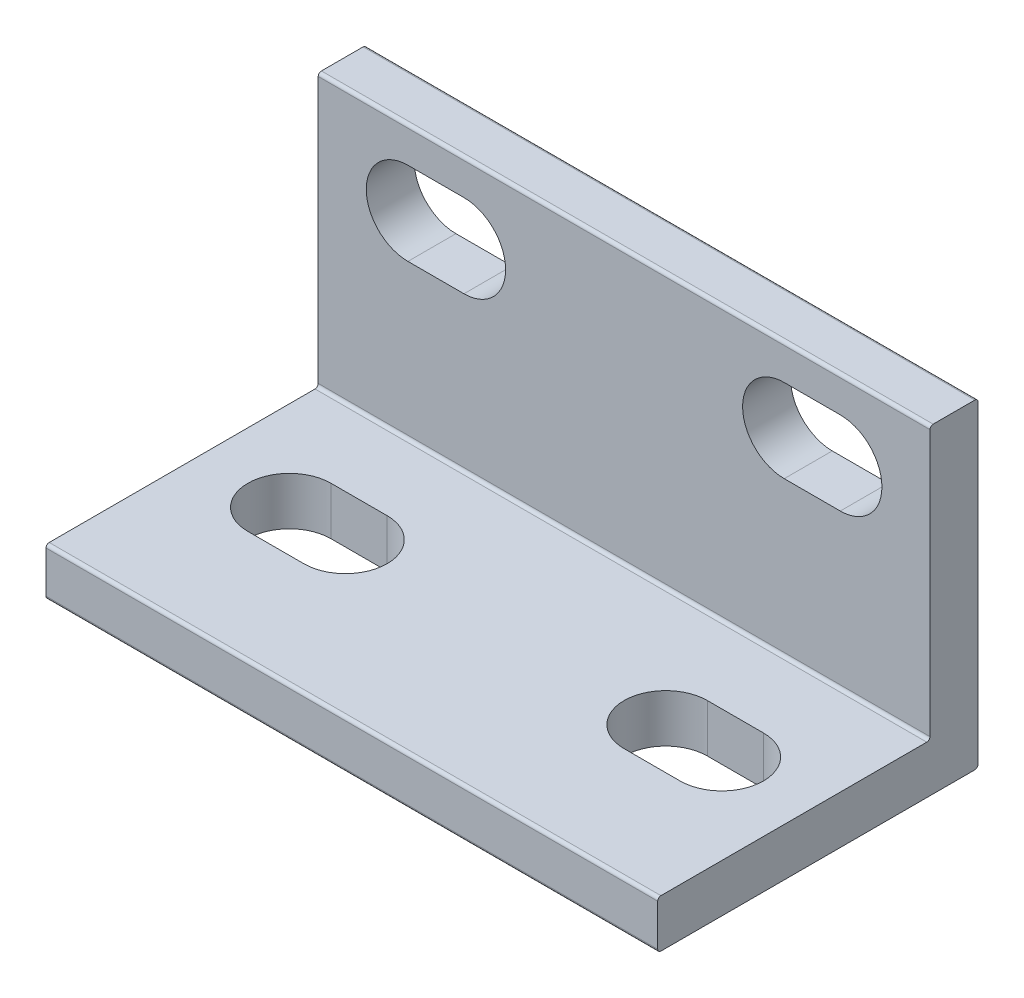
ISO-10303-21;
HEADER;
FILE_DESCRIPTION(('STEP AP214'),'2;1');
FILE_NAME('part.step','',(''),(''),'','','');
FILE_SCHEMA(('AUTOMOTIVE_DESIGN { 1 0 10303 214 1 1 1 1 }'));
ENDSEC;
DATA;
#1=APPLICATION_CONTEXT('core data for automotive mechanical design processes');
#2=APPLICATION_PROTOCOL_DEFINITION('international standard','automotive_design',2000,#1);
#3=PRODUCT_CONTEXT('',#1,'mechanical');
#4=PRODUCT('Part','Part','',(#3));
#5=PRODUCT_RELATED_PRODUCT_CATEGORY('part','',(#4));
#6=PRODUCT_DEFINITION_FORMATION('','',#4);
#7=PRODUCT_DEFINITION_CONTEXT('part definition',#1,'design');
#8=PRODUCT_DEFINITION('design','',#6,#7);
#9=PRODUCT_DEFINITION_SHAPE('','',#8);
#10=(LENGTH_UNIT() NAMED_UNIT(*) SI_UNIT(.MILLI.,.METRE.));
#11=(NAMED_UNIT(*) PLANE_ANGLE_UNIT() SI_UNIT($,.RADIAN.));
#12=(NAMED_UNIT(*) SI_UNIT($,.STERADIAN.) SOLID_ANGLE_UNIT());
#13=UNCERTAINTY_MEASURE_WITH_UNIT(LENGTH_MEASURE(1.E-05),#10,'distance_accuracy_value','');
#14=(GEOMETRIC_REPRESENTATION_CONTEXT(3) GLOBAL_UNCERTAINTY_ASSIGNED_CONTEXT((#13)) GLOBAL_UNIT_ASSIGNED_CONTEXT((#10,
#11,#12)) REPRESENTATION_CONTEXT('',''));
#15=CARTESIAN_POINT('',(0.,0.,0.));
#16=DIRECTION('',(0.,0.,1.));
#17=DIRECTION('',(1.,0.,0.));
#18=AXIS2_PLACEMENT_3D('',#15,#16,#17);
#19=CARTESIAN_POINT('',(0.,17.,3.));
#20=DIRECTION('',(1.,0.,0.));
#21=DIRECTION('',(0.,0.,-1.));
#22=AXIS2_PLACEMENT_3D('',#19,#20,#21);
#23=PLANE('',#22);
#24=DIRECTION('',(0.,-1.,0.));
#25=VECTOR('',#24,1.);
#26=CARTESIAN_POINT('',(0.,17.,3.));
#27=LINE('',#26,#25);
#28=CARTESIAN_POINT('',(0.,16.8,3.));
#29=VERTEX_POINT('',#28);
#30=CARTESIAN_POINT('',(0.,0.199999999999999,3.));
#31=VERTEX_POINT('',#30);
#32=EDGE_CURVE('E360',#29,#31,#27,.T.);
#33=ORIENTED_EDGE('',*,*,#32,.F.);
#34=CARTESIAN_POINT('',(0.,16.8,2.8));
#35=DIRECTION('',(1.,0.,0.));
#36=DIRECTION('',(0.,0.,-1.));
#37=AXIS2_PLACEMENT_3D('',#34,#35,#36);
#38=CIRCLE('',#37,0.2);
#39=CARTESIAN_POINT('',(0.,17.,2.8));
#40=VERTEX_POINT('',#39);
#41=EDGE_CURVE('E391',#29,#40,#38,.F.);
#42=ORIENTED_EDGE('',*,*,#41,.T.);
#43=DIRECTION('',(0.,0.,-1.));
#44=VECTOR('',#43,1.);
#45=CARTESIAN_POINT('',(0.,17.,3.));
#46=LINE('',#45,#44);
#47=CARTESIAN_POINT('',(0.,17.,0.2));
#48=VERTEX_POINT('',#47);
#49=EDGE_CURVE('E367',#40,#48,#46,.T.);
#50=ORIENTED_EDGE('',*,*,#49,.T.);
#51=CARTESIAN_POINT('',(0.,16.8,0.2));
#52=DIRECTION('',(1.,0.,0.));
#53=DIRECTION('',(0.,0.,-1.));
#54=AXIS2_PLACEMENT_3D('',#51,#52,#53);
#55=CIRCLE('',#54,0.2);
#56=CARTESIAN_POINT('',(0.,16.8,0.));
#57=VERTEX_POINT('',#56);
#58=EDGE_CURVE('E389',#48,#57,#55,.F.);
#59=ORIENTED_EDGE('',*,*,#58,.T.);
#60=DIRECTION('',(0.,-1.,0.));
#61=VECTOR('',#60,1.);
#62=CARTESIAN_POINT('',(0.,17.,0.));
#63=LINE('',#62,#61);
#64=CARTESIAN_POINT('',(0.,-2.8,0.));
#65=VERTEX_POINT('',#64);
#66=EDGE_CURVE('E359',#57,#65,#63,.T.);
#67=ORIENTED_EDGE('',*,*,#66,.T.);
#68=CARTESIAN_POINT('',(0.,-2.8,0.2));
#69=DIRECTION('',(1.,0.,0.));
#70=DIRECTION('',(0.,0.,-1.));
#71=AXIS2_PLACEMENT_3D('',#68,#69,#70);
#72=CIRCLE('',#71,0.2);
#73=CARTESIAN_POINT('',(0.,-3.,0.2));
#74=VERTEX_POINT('',#73);
#75=EDGE_CURVE('E387',#65,#74,#72,.F.);
#76=ORIENTED_EDGE('',*,*,#75,.T.);
#77=DIRECTION('',(0.,0.,-1.));
#78=VECTOR('',#77,1.);
#79=CARTESIAN_POINT('',(0.,-3.,0.));
#80=LINE('',#79,#78);
#81=CARTESIAN_POINT('',(0.,-3.,19.8));
#82=VERTEX_POINT('',#81);
#83=EDGE_CURVE('E345',#82,#74,#80,.T.);
#84=ORIENTED_EDGE('',*,*,#83,.F.);
#85=CARTESIAN_POINT('',(0.,-2.8,19.8));
#86=DIRECTION('',(1.,0.,0.));
#87=DIRECTION('',(0.,0.,-1.));
#88=AXIS2_PLACEMENT_3D('',#85,#86,#87);
#89=CIRCLE('',#88,0.2);
#90=CARTESIAN_POINT('',(0.,-2.8,20.));
#91=VERTEX_POINT('',#90);
#92=EDGE_CURVE('E383',#82,#91,#89,.F.);
#93=ORIENTED_EDGE('',*,*,#92,.T.);
#94=DIRECTION('',(0.,1.,0.));
#95=VECTOR('',#94,1.);
#96=CARTESIAN_POINT('',(0.,-3.,20.));
#97=LINE('',#96,#95);
#98=CARTESIAN_POINT('',(0.,-0.2,20.));
#99=VERTEX_POINT('',#98);
#100=EDGE_CURVE('E349',#91,#99,#97,.T.);
#101=ORIENTED_EDGE('',*,*,#100,.T.);
#102=CARTESIAN_POINT('',(0.,-0.2,19.8));
#103=DIRECTION('',(1.,0.,0.));
#104=DIRECTION('',(0.,0.,-1.));
#105=AXIS2_PLACEMENT_3D('',#102,#103,#104);
#106=CIRCLE('',#105,0.2);
#107=CARTESIAN_POINT('',(0.,0.,19.8));
#108=VERTEX_POINT('',#107);
#109=EDGE_CURVE('E385',#99,#108,#106,.F.);
#110=ORIENTED_EDGE('',*,*,#109,.T.);
#111=DIRECTION('',(0.,0.,-1.));
#112=VECTOR('',#111,1.);
#113=CARTESIAN_POINT('',(0.,0.,0.));
#114=LINE('',#113,#112);
#115=CARTESIAN_POINT('',(0.,0.,3.2));
#116=VERTEX_POINT('',#115);
#117=EDGE_CURVE('E346',#108,#116,#114,.T.);
#118=ORIENTED_EDGE('',*,*,#117,.T.);
#119=CARTESIAN_POINT('',(0.,0.2,3.2));
#120=DIRECTION('',(1.,0.,0.));
#121=DIRECTION('',(0.,0.,-1.));
#122=AXIS2_PLACEMENT_3D('',#119,#120,#121);
#123=CIRCLE('',#122,0.2);
#124=EDGE_CURVE('E10',#116,#31,#123,.T.);
#125=ORIENTED_EDGE('',*,*,#124,.T.);
#126=EDGE_LOOP('',(#33,#42,#50,#59,#67,#76,#84,#93,#101,#110,#118,#125));
#127=FACE_BOUND('',#126,.T.);
#128=ADVANCED_FACE('F16',(#127),#23,.F.);
#129=CARTESIAN_POINT('',(38.2,0.,3.));
#130=DIRECTION('',(-1.,0.,0.));
#131=DIRECTION('',(0.,0.,1.));
#132=AXIS2_PLACEMENT_3D('',#129,#130,#131);
#133=PLANE('',#132);
#134=DIRECTION('',(0.,0.,-1.));
#135=VECTOR('',#134,1.);
#136=CARTESIAN_POINT('',(38.2,17.,3.));
#137=LINE('',#136,#135);
#138=CARTESIAN_POINT('',(38.2,17.,2.8));
#139=VERTEX_POINT('',#138);
#140=CARTESIAN_POINT('',(38.2,17.,0.2));
#141=VERTEX_POINT('',#140);
#142=EDGE_CURVE('E374',#139,#141,#137,.T.);
#143=ORIENTED_EDGE('',*,*,#142,.F.);
#144=CARTESIAN_POINT('',(38.2,16.8,2.8));
#145=DIRECTION('',(-1.,0.,0.));
#146=DIRECTION('',(0.,0.,1.));
#147=AXIS2_PLACEMENT_3D('',#144,#145,#146);
#148=CIRCLE('',#147,0.2);
#149=CARTESIAN_POINT('',(38.2,16.8,3.));
#150=VERTEX_POINT('',#149);
#151=EDGE_CURVE('E404',#139,#150,#148,.F.);
#152=ORIENTED_EDGE('',*,*,#151,.T.);
#153=DIRECTION('',(0.,1.,0.));
#154=VECTOR('',#153,1.);
#155=CARTESIAN_POINT('',(38.2,0.,3.));
#156=LINE('',#155,#154);
#157=CARTESIAN_POINT('',(38.2,0.2,3.));
#158=VERTEX_POINT('',#157);
#159=EDGE_CURVE('E363',#158,#150,#156,.T.);
#160=ORIENTED_EDGE('',*,*,#159,.F.);
#161=CARTESIAN_POINT('',(38.2,0.2,3.2));
#162=DIRECTION('',(-1.,0.,0.));
#163=DIRECTION('',(0.,0.,1.));
#164=AXIS2_PLACEMENT_3D('',#161,#162,#163);
#165=CIRCLE('',#164,0.2);
#166=CARTESIAN_POINT('',(38.2,0.,3.2));
#167=VERTEX_POINT('',#166);
#168=EDGE_CURVE('E24',#158,#167,#165,.T.);
#169=ORIENTED_EDGE('',*,*,#168,.T.);
#170=DIRECTION('',(0.,0.,1.));
#171=VECTOR('',#170,1.);
#172=CARTESIAN_POINT('',(38.2,0.,20.));
#173=LINE('',#172,#171);
#174=CARTESIAN_POINT('',(38.2,0.,19.8));
#175=VERTEX_POINT('',#174);
#176=EDGE_CURVE('E306',#167,#175,#173,.T.);
#177=ORIENTED_EDGE('',*,*,#176,.T.);
#178=CARTESIAN_POINT('',(38.2,-0.2,19.8));
#179=DIRECTION('',(-1.,0.,0.));
#180=DIRECTION('',(0.,0.,1.));
#181=AXIS2_PLACEMENT_3D('',#178,#179,#180);
#182=CIRCLE('',#181,0.2);
#183=CARTESIAN_POINT('',(38.2,-0.2,20.));
#184=VERTEX_POINT('',#183);
#185=EDGE_CURVE('E399',#175,#184,#182,.F.);
#186=ORIENTED_EDGE('',*,*,#185,.T.);
#187=DIRECTION('',(0.,1.,0.));
#188=VECTOR('',#187,1.);
#189=CARTESIAN_POINT('',(38.2,-3.,20.));
#190=LINE('',#189,#188);
#191=CARTESIAN_POINT('',(38.2,-2.8,20.));
#192=VERTEX_POINT('',#191);
#193=EDGE_CURVE('E356',#192,#184,#190,.T.);
#194=ORIENTED_EDGE('',*,*,#193,.F.);
#195=CARTESIAN_POINT('',(38.2,-2.8,19.8));
#196=DIRECTION('',(-1.,0.,0.));
#197=DIRECTION('',(0.,0.,1.));
#198=AXIS2_PLACEMENT_3D('',#195,#196,#197);
#199=CIRCLE('',#198,0.2);
#200=CARTESIAN_POINT('',(38.2,-3.,19.8));
#201=VERTEX_POINT('',#200);
#202=EDGE_CURVE('E31',#192,#201,#199,.F.);
#203=ORIENTED_EDGE('',*,*,#202,.T.);
#204=DIRECTION('',(0.,0.,1.));
#205=VECTOR('',#204,1.);
#206=CARTESIAN_POINT('',(38.2,-3.,20.));
#207=LINE('',#206,#205);
#208=CARTESIAN_POINT('',(38.2,-3.,0.199999999999999));
#209=VERTEX_POINT('',#208);
#210=EDGE_CURVE('E343',#209,#201,#207,.T.);
#211=ORIENTED_EDGE('',*,*,#210,.F.);
#212=CARTESIAN_POINT('',(38.2,-2.8,0.2));
#213=DIRECTION('',(-1.,0.,0.));
#214=DIRECTION('',(0.,0.,1.));
#215=AXIS2_PLACEMENT_3D('',#212,#213,#214);
#216=CIRCLE('',#215,0.2);
#217=CARTESIAN_POINT('',(38.2,-2.8,0.));
#218=VERTEX_POINT('',#217);
#219=EDGE_CURVE('E39',#209,#218,#216,.F.);
#220=ORIENTED_EDGE('',*,*,#219,.T.);
#221=DIRECTION('',(0.,1.,0.));
#222=VECTOR('',#221,1.);
#223=CARTESIAN_POINT('',(38.2,0.,0.));
#224=LINE('',#223,#222);
#225=CARTESIAN_POINT('',(38.2,16.8,0.));
#226=VERTEX_POINT('',#225);
#227=EDGE_CURVE('E364',#218,#226,#224,.T.);
#228=ORIENTED_EDGE('',*,*,#227,.T.);
#229=CARTESIAN_POINT('',(38.2,16.8,0.2));
#230=DIRECTION('',(-1.,0.,0.));
#231=DIRECTION('',(0.,0.,1.));
#232=AXIS2_PLACEMENT_3D('',#229,#230,#231);
#233=CIRCLE('',#232,0.2);
#234=EDGE_CURVE('E402',#226,#141,#233,.F.);
#235=ORIENTED_EDGE('',*,*,#234,.T.);
#236=EDGE_LOOP('',(#143,#152,#160,#169,#177,#186,#194,#203,#211,#220,#228,#235));
#237=FACE_BOUND('',#236,.T.);
#238=ADVANCED_FACE('F426',(#237),#133,.F.);
#239=CARTESIAN_POINT('',(38.2,17.,3.));
#240=DIRECTION('',(0.,-1.,0.));
#241=DIRECTION('',(1.,0.,0.));
#242=AXIS2_PLACEMENT_3D('',#239,#240,#241);
#243=PLANE('',#242);
#244=ORIENTED_EDGE('',*,*,#49,.F.);
#245=DIRECTION('',(-1.,0.,0.));
#246=VECTOR('',#245,1.);
#247=CARTESIAN_POINT('',(38.2,17.,2.8));
#248=LINE('',#247,#246);
#249=EDGE_CURVE('E396',#40,#139,#248,.F.);
#250=ORIENTED_EDGE('',*,*,#249,.T.);
#251=ORIENTED_EDGE('',*,*,#142,.T.);
#252=DIRECTION('',(-1.,0.,0.));
#253=VECTOR('',#252,1.);
#254=CARTESIAN_POINT('',(38.2,17.,0.2));
#255=LINE('',#254,#253);
#256=EDGE_CURVE('E393',#141,#48,#255,.T.);
#257=ORIENTED_EDGE('',*,*,#256,.T.);
#258=EDGE_LOOP('',(#244,#250,#251,#257));
#259=FACE_BOUND('',#258,.T.);
#260=ADVANCED_FACE('F448',(#259),#243,.F.);
#261=CARTESIAN_POINT('',(0.,0.,3.));
#262=DIRECTION('',(0.,0.,1.));
#263=DIRECTION('',(1.,0.,0.));
#264=AXIS2_PLACEMENT_3D('',#261,#262,#263);
#265=PLANE('',#264);
#266=CARTESIAN_POINT('',(5.6,12.2,3.));
#267=DIRECTION('',(0.,0.,1.));
#268=DIRECTION('',(1.,0.,0.));
#269=AXIS2_PLACEMENT_3D('',#266,#267,#268);
#270=CIRCLE('',#269,2.6);
#271=CARTESIAN_POINT('',(5.6,14.8,3.));
#272=VERTEX_POINT('',#271);
#273=CARTESIAN_POINT('',(5.6,9.6,3.));
#274=VERTEX_POINT('',#273);
#275=EDGE_CURVE('E210',#272,#274,#270,.T.);
#276=ORIENTED_EDGE('',*,*,#275,.F.);
#277=DIRECTION('',(-1.,0.,0.));
#278=VECTOR('',#277,1.);
#279=CARTESIAN_POINT('',(5.6,14.8,3.));
#280=LINE('',#279,#278);
#281=CARTESIAN_POINT('',(9.1,14.8,3.));
#282=VERTEX_POINT('',#281);
#283=EDGE_CURVE('E228',#282,#272,#280,.T.);
#284=ORIENTED_EDGE('',*,*,#283,.F.);
#285=CARTESIAN_POINT('',(9.1,12.2,3.));
#286=DIRECTION('',(0.,0.,1.));
#287=DIRECTION('',(1.,0.,0.));
#288=AXIS2_PLACEMENT_3D('',#285,#286,#287);
#289=CIRCLE('',#288,2.6);
#290=CARTESIAN_POINT('',(9.1,9.6,3.));
#291=VERTEX_POINT('',#290);
#292=EDGE_CURVE('E231',#291,#282,#289,.T.);
#293=ORIENTED_EDGE('',*,*,#292,.F.);
#294=DIRECTION('',(1.,0.,0.));
#295=VECTOR('',#294,1.);
#296=CARTESIAN_POINT('',(5.6,9.6,3.));
#297=LINE('',#296,#295);
#298=EDGE_CURVE('E237',#274,#291,#297,.T.);
#299=ORIENTED_EDGE('',*,*,#298,.F.);
#300=EDGE_LOOP('',(#276,#284,#293,#299));
#301=FACE_BOUND('',#300,.T.);
#302=CARTESIAN_POINT('',(32.6,12.2,3.));
#303=DIRECTION('',(0.,0.,1.));
#304=DIRECTION('',(-1.,0.,0.));
#305=AXIS2_PLACEMENT_3D('',#302,#303,#304);
#306=CIRCLE('',#305,2.6);
#307=CARTESIAN_POINT('',(32.6,9.6,3.));
#308=VERTEX_POINT('',#307);
#309=CARTESIAN_POINT('',(32.6,14.8,3.));
#310=VERTEX_POINT('',#309);
#311=EDGE_CURVE('E262',#308,#310,#306,.T.);
#312=ORIENTED_EDGE('',*,*,#311,.F.);
#313=DIRECTION('',(1.,0.,0.));
#314=VECTOR('',#313,1.);
#315=CARTESIAN_POINT('',(32.6,9.6,3.));
#316=LINE('',#315,#314);
#317=CARTESIAN_POINT('',(29.1,9.6,3.));
#318=VERTEX_POINT('',#317);
#319=EDGE_CURVE('E252',#318,#308,#316,.T.);
#320=ORIENTED_EDGE('',*,*,#319,.F.);
#321=CARTESIAN_POINT('',(29.1,12.2,3.));
#322=DIRECTION('',(0.,0.,1.));
#323=DIRECTION('',(-1.,0.,0.));
#324=AXIS2_PLACEMENT_3D('',#321,#322,#323);
#325=CIRCLE('',#324,2.6);
#326=CARTESIAN_POINT('',(29.1,14.8,3.));
#327=VERTEX_POINT('',#326);
#328=EDGE_CURVE('E267',#327,#318,#325,.T.);
#329=ORIENTED_EDGE('',*,*,#328,.F.);
#330=DIRECTION('',(-1.,0.,0.));
#331=VECTOR('',#330,1.);
#332=CARTESIAN_POINT('',(32.6,14.8,3.));
#333=LINE('',#332,#331);
#334=EDGE_CURVE('E264',#310,#327,#333,.T.);
#335=ORIENTED_EDGE('',*,*,#334,.F.);
#336=EDGE_LOOP('',(#312,#320,#329,#335));
#337=FACE_BOUND('',#336,.T.);
#338=ORIENTED_EDGE('',*,*,#159,.T.);
#339=DIRECTION('',(-1.,0.,0.));
#340=VECTOR('',#339,1.);
#341=CARTESIAN_POINT('',(0.,16.8,3.));
#342=LINE('',#341,#340);
#343=EDGE_CURVE('E380',#150,#29,#342,.T.);
#344=ORIENTED_EDGE('',*,*,#343,.T.);
#345=ORIENTED_EDGE('',*,*,#32,.T.);
#346=DIRECTION('',(1.,0.,0.));
#347=VECTOR('',#346,1.);
#348=CARTESIAN_POINT('',(38.2,0.2,3.));
#349=LINE('',#348,#347);
#350=EDGE_CURVE('E377',#31,#158,#349,.T.);
#351=ORIENTED_EDGE('',*,*,#350,.T.);
#352=EDGE_LOOP('',(#338,#344,#345,#351));
#353=FACE_BOUND('',#352,.T.);
#354=ADVANCED_FACE('F440',(#301,#337,#353),#265,.T.);
#355=CARTESIAN_POINT('',(0.,0.,0.));
#356=DIRECTION('',(0.,0.,1.));
#357=DIRECTION('',(1.,0.,0.));
#358=AXIS2_PLACEMENT_3D('',#355,#356,#357);
#359=PLANE('',#358);
#360=DIRECTION('',(-1.,0.,0.));
#361=VECTOR('',#360,1.);
#362=CARTESIAN_POINT('',(5.6,14.8,0.));
#363=LINE('',#362,#361);
#364=CARTESIAN_POINT('',(9.1,14.8,0.));
#365=VERTEX_POINT('',#364);
#366=CARTESIAN_POINT('',(5.6,14.8,0.));
#367=VERTEX_POINT('',#366);
#368=EDGE_CURVE('E215',#365,#367,#363,.T.);
#369=ORIENTED_EDGE('',*,*,#368,.T.);
#370=CARTESIAN_POINT('',(5.6,12.2,0.));
#371=DIRECTION('',(0.,0.,1.));
#372=DIRECTION('',(1.,0.,0.));
#373=AXIS2_PLACEMENT_3D('',#370,#371,#372);
#374=CIRCLE('',#373,2.6);
#375=CARTESIAN_POINT('',(5.6,9.6,0.));
#376=VERTEX_POINT('',#375);
#377=EDGE_CURVE('E207',#367,#376,#374,.T.);
#378=ORIENTED_EDGE('',*,*,#377,.T.);
#379=DIRECTION('',(1.,0.,0.));
#380=VECTOR('',#379,1.);
#381=CARTESIAN_POINT('',(5.6,9.6,0.));
#382=LINE('',#381,#380);
#383=CARTESIAN_POINT('',(9.1,9.6,0.));
#384=VERTEX_POINT('',#383);
#385=EDGE_CURVE('E219',#376,#384,#382,.T.);
#386=ORIENTED_EDGE('',*,*,#385,.T.);
#387=CARTESIAN_POINT('',(9.1,12.2,0.));
#388=DIRECTION('',(0.,0.,1.));
#389=DIRECTION('',(1.,0.,0.));
#390=AXIS2_PLACEMENT_3D('',#387,#388,#389);
#391=CIRCLE('',#390,2.6);
#392=EDGE_CURVE('E223',#384,#365,#391,.T.);
#393=ORIENTED_EDGE('',*,*,#392,.T.);
#394=EDGE_LOOP('',(#369,#378,#386,#393));
#395=FACE_BOUND('',#394,.T.);
#396=DIRECTION('',(1.,0.,0.));
#397=VECTOR('',#396,1.);
#398=CARTESIAN_POINT('',(32.6,9.6,0.));
#399=LINE('',#398,#397);
#400=CARTESIAN_POINT('',(29.1,9.6,0.));
#401=VERTEX_POINT('',#400);
#402=CARTESIAN_POINT('',(32.6,9.6,0.));
#403=VERTEX_POINT('',#402);
#404=EDGE_CURVE('E258',#401,#403,#399,.T.);
#405=ORIENTED_EDGE('',*,*,#404,.T.);
#406=CARTESIAN_POINT('',(32.6,12.2,0.));
#407=DIRECTION('',(0.,0.,1.));
#408=DIRECTION('',(-1.,0.,0.));
#409=AXIS2_PLACEMENT_3D('',#406,#407,#408);
#410=CIRCLE('',#409,2.6);
#411=CARTESIAN_POINT('',(32.6,14.8,0.));
#412=VERTEX_POINT('',#411);
#413=EDGE_CURVE('E248',#403,#412,#410,.T.);
#414=ORIENTED_EDGE('',*,*,#413,.T.);
#415=DIRECTION('',(-1.,0.,0.));
#416=VECTOR('',#415,1.);
#417=CARTESIAN_POINT('',(32.6,14.8,0.));
#418=LINE('',#417,#416);
#419=CARTESIAN_POINT('',(29.1,14.8,0.));
#420=VERTEX_POINT('',#419);
#421=EDGE_CURVE('E251',#412,#420,#418,.T.);
#422=ORIENTED_EDGE('',*,*,#421,.T.);
#423=CARTESIAN_POINT('',(29.1,12.2,0.));
#424=DIRECTION('',(0.,0.,1.));
#425=DIRECTION('',(-1.,0.,0.));
#426=AXIS2_PLACEMENT_3D('',#423,#424,#425);
#427=CIRCLE('',#426,2.6);
#428=EDGE_CURVE('E255',#420,#401,#427,.T.);
#429=ORIENTED_EDGE('',*,*,#428,.T.);
#430=EDGE_LOOP('',(#405,#414,#422,#429));
#431=FACE_BOUND('',#430,.T.);
#432=ORIENTED_EDGE('',*,*,#66,.F.);
#433=DIRECTION('',(-1.,0.,0.));
#434=VECTOR('',#433,1.);
#435=CARTESIAN_POINT('',(0.,16.8,0.));
#436=LINE('',#435,#434);
#437=EDGE_CURVE('E408',#57,#226,#436,.F.);
#438=ORIENTED_EDGE('',*,*,#437,.T.);
#439=ORIENTED_EDGE('',*,*,#227,.F.);
#440=DIRECTION('',(1.,0.,0.));
#441=VECTOR('',#440,1.);
#442=CARTESIAN_POINT('',(0.,-2.8,0.));
#443=LINE('',#442,#441);
#444=EDGE_CURVE('E406',#218,#65,#443,.F.);
#445=ORIENTED_EDGE('',*,*,#444,.T.);
#446=EDGE_LOOP('',(#432,#438,#439,#445));
#447=FACE_BOUND('',#446,.T.);
#448=ADVANCED_FACE('F225',(#395,#431,#447),#359,.F.);
#449=CARTESIAN_POINT('',(0.,0.,0.));
#450=DIRECTION('',(0.,1.,0.));
#451=DIRECTION('',(0.,0.,1.));
#452=AXIS2_PLACEMENT_3D('',#449,#450,#451);
#453=PLANE('',#452);
#454=CARTESIAN_POINT('',(5.59999999999999,0.,10.4));
#455=DIRECTION('',(0.,1.,0.));
#456=DIRECTION('',(0.,0.,1.));
#457=AXIS2_PLACEMENT_3D('',#454,#455,#456);
#458=CIRCLE('',#457,2.60000000000001);
#459=CARTESIAN_POINT('',(5.59999999999999,0.,7.79999999999997));
#460=VERTEX_POINT('',#459);
#461=CARTESIAN_POINT('',(5.59999999999999,0.,13.));
#462=VERTEX_POINT('',#461);
#463=EDGE_CURVE('E293',#460,#462,#458,.T.);
#464=ORIENTED_EDGE('',*,*,#463,.F.);
#465=DIRECTION('',(-1.,0.,0.));
#466=VECTOR('',#465,1.);
#467=CARTESIAN_POINT('',(5.59999999999999,0.,7.79999999999997));
#468=LINE('',#467,#466);
#469=CARTESIAN_POINT('',(9.10000000000001,0.,7.79999999999997));
#470=VERTEX_POINT('',#469);
#471=EDGE_CURVE('E283',#470,#460,#468,.T.);
#472=ORIENTED_EDGE('',*,*,#471,.F.);
#473=CARTESIAN_POINT('',(9.10000000000001,0.,10.4));
#474=DIRECTION('',(0.,1.,0.));
#475=DIRECTION('',(0.,0.,1.));
#476=AXIS2_PLACEMENT_3D('',#473,#474,#475);
#477=CIRCLE('',#476,2.60000000000001);
#478=CARTESIAN_POINT('',(9.10000000000001,0.,13.));
#479=VERTEX_POINT('',#478);
#480=EDGE_CURVE('E299',#479,#470,#477,.T.);
#481=ORIENTED_EDGE('',*,*,#480,.F.);
#482=DIRECTION('',(1.,0.,0.));
#483=VECTOR('',#482,1.);
#484=CARTESIAN_POINT('',(5.59999999999999,0.,13.));
#485=LINE('',#484,#483);
#486=EDGE_CURVE('E295',#462,#479,#485,.T.);
#487=ORIENTED_EDGE('',*,*,#486,.F.);
#488=EDGE_LOOP('',(#464,#472,#481,#487));
#489=FACE_BOUND('',#488,.T.);
#490=CARTESIAN_POINT('',(32.6,0.,10.4));
#491=DIRECTION('',(0.,1.,0.));
#492=DIRECTION('',(0.,0.,-1.));
#493=AXIS2_PLACEMENT_3D('',#490,#491,#492);
#494=CIRCLE('',#493,2.60000000000001);
#495=CARTESIAN_POINT('',(32.6,0.,13.));
#496=VERTEX_POINT('',#495);
#497=CARTESIAN_POINT('',(32.6,0.,7.79999999999997));
#498=VERTEX_POINT('',#497);
#499=EDGE_CURVE('E244',#496,#498,#494,.T.);
#500=ORIENTED_EDGE('',*,*,#499,.F.);
#501=DIRECTION('',(1.,0.,0.));
#502=VECTOR('',#501,1.);
#503=CARTESIAN_POINT('',(32.6,0.,13.));
#504=LINE('',#503,#502);
#505=CARTESIAN_POINT('',(29.1,0.,13.));
#506=VERTEX_POINT('',#505);
#507=EDGE_CURVE('E317',#506,#496,#504,.T.);
#508=ORIENTED_EDGE('',*,*,#507,.F.);
#509=CARTESIAN_POINT('',(29.1,0.,10.4));
#510=DIRECTION('',(0.,1.,0.));
#511=DIRECTION('',(0.,0.,-1.));
#512=AXIS2_PLACEMENT_3D('',#509,#510,#511);
#513=CIRCLE('',#512,2.60000000000001);
#514=CARTESIAN_POINT('',(29.1,0.,7.79999999999997));
#515=VERTEX_POINT('',#514);
#516=EDGE_CURVE('E331',#515,#506,#513,.T.);
#517=ORIENTED_EDGE('',*,*,#516,.F.);
#518=DIRECTION('',(-1.,0.,0.));
#519=VECTOR('',#518,1.);
#520=CARTESIAN_POINT('',(32.6,0.,7.79999999999997));
#521=LINE('',#520,#519);
#522=EDGE_CURVE('E328',#498,#515,#521,.T.);
#523=ORIENTED_EDGE('',*,*,#522,.F.);
#524=EDGE_LOOP('',(#500,#508,#517,#523));
#525=FACE_BOUND('',#524,.T.);
#526=ORIENTED_EDGE('',*,*,#176,.F.);
#527=DIRECTION('',(1.,0.,0.));
#528=VECTOR('',#527,1.);
#529=CARTESIAN_POINT('',(0.,0.,3.2));
#530=LINE('',#529,#528);
#531=EDGE_CURVE('E417',#167,#116,#530,.F.);
#532=ORIENTED_EDGE('',*,*,#531,.T.);
#533=ORIENTED_EDGE('',*,*,#117,.F.);
#534=DIRECTION('',(-1.,0.,0.));
#535=VECTOR('',#534,1.);
#536=CARTESIAN_POINT('',(38.2,0.,19.8));
#537=LINE('',#536,#535);
#538=EDGE_CURVE('E415',#108,#175,#537,.F.);
#539=ORIENTED_EDGE('',*,*,#538,.T.);
#540=EDGE_LOOP('',(#526,#532,#533,#539));
#541=FACE_BOUND('',#540,.T.);
#542=ADVANCED_FACE('F432',(#489,#525,#541),#453,.T.);
#543=CARTESIAN_POINT('',(0.,-3.,20.));
#544=DIRECTION('',(0.,0.,-1.));
#545=DIRECTION('',(-1.,0.,0.));
#546=AXIS2_PLACEMENT_3D('',#543,#544,#545);
#547=PLANE('',#546);
#548=ORIENTED_EDGE('',*,*,#193,.T.);
#549=DIRECTION('',(-1.,0.,0.));
#550=VECTOR('',#549,1.);
#551=CARTESIAN_POINT('',(0.,-0.2,20.));
#552=LINE('',#551,#550);
#553=EDGE_CURVE('E421',#184,#99,#552,.T.);
#554=ORIENTED_EDGE('',*,*,#553,.T.);
#555=ORIENTED_EDGE('',*,*,#100,.F.);
#556=DIRECTION('',(-1.,0.,0.));
#557=VECTOR('',#556,1.);
#558=CARTESIAN_POINT('',(0.,-2.8,20.));
#559=LINE('',#558,#557);
#560=EDGE_CURVE('E419',#91,#192,#559,.F.);
#561=ORIENTED_EDGE('',*,*,#560,.T.);
#562=EDGE_LOOP('',(#548,#554,#555,#561));
#563=FACE_BOUND('',#562,.T.);
#564=ADVANCED_FACE('F467',(#563),#547,.F.);
#565=CARTESIAN_POINT('',(0.,-3.,0.));
#566=DIRECTION('',(0.,1.,0.));
#567=DIRECTION('',(0.,0.,1.));
#568=AXIS2_PLACEMENT_3D('',#565,#566,#567);
#569=PLANE('',#568);
#570=DIRECTION('',(-1.,0.,0.));
#571=VECTOR('',#570,1.);
#572=CARTESIAN_POINT('',(5.59999999999999,-3.,7.79999999999997));
#573=LINE('',#572,#571);
#574=CARTESIAN_POINT('',(9.10000000000001,-3.,7.79999999999997));
#575=VERTEX_POINT('',#574);
#576=CARTESIAN_POINT('',(5.59999999999999,-3.,7.79999999999997));
#577=VERTEX_POINT('',#576);
#578=EDGE_CURVE('E289',#575,#577,#573,.T.);
#579=ORIENTED_EDGE('',*,*,#578,.T.);
#580=CARTESIAN_POINT('',(5.59999999999999,-3.,10.4));
#581=DIRECTION('',(0.,1.,0.));
#582=DIRECTION('',(0.,0.,1.));
#583=AXIS2_PLACEMENT_3D('',#580,#581,#582);
#584=CIRCLE('',#583,2.60000000000001);
#585=CARTESIAN_POINT('',(5.59999999999999,-3.,13.));
#586=VERTEX_POINT('',#585);
#587=EDGE_CURVE('E279',#577,#586,#584,.T.);
#588=ORIENTED_EDGE('',*,*,#587,.T.);
#589=DIRECTION('',(1.,0.,0.));
#590=VECTOR('',#589,1.);
#591=CARTESIAN_POINT('',(5.59999999999999,-3.,13.));
#592=LINE('',#591,#590);
#593=CARTESIAN_POINT('',(9.10000000000001,-3.,13.));
#594=VERTEX_POINT('',#593);
#595=EDGE_CURVE('E282',#586,#594,#592,.T.);
#596=ORIENTED_EDGE('',*,*,#595,.T.);
#597=CARTESIAN_POINT('',(9.10000000000001,-3.,10.4));
#598=DIRECTION('',(0.,1.,0.));
#599=DIRECTION('',(0.,0.,1.));
#600=AXIS2_PLACEMENT_3D('',#597,#598,#599);
#601=CIRCLE('',#600,2.60000000000001);
#602=EDGE_CURVE('E286',#594,#575,#601,.T.);
#603=ORIENTED_EDGE('',*,*,#602,.T.);
#604=EDGE_LOOP('',(#579,#588,#596,#603));
#605=FACE_BOUND('',#604,.T.);
#606=DIRECTION('',(1.,0.,0.));
#607=VECTOR('',#606,1.);
#608=CARTESIAN_POINT('',(32.6,-3.,13.));
#609=LINE('',#608,#607);
#610=CARTESIAN_POINT('',(29.1,-3.,13.));
#611=VERTEX_POINT('',#610);
#612=CARTESIAN_POINT('',(32.6,-3.,13.));
#613=VERTEX_POINT('',#612);
#614=EDGE_CURVE('E323',#611,#613,#609,.T.);
#615=ORIENTED_EDGE('',*,*,#614,.T.);
#616=CARTESIAN_POINT('',(32.6,-3.,10.4));
#617=DIRECTION('',(0.,1.,0.));
#618=DIRECTION('',(0.,0.,-1.));
#619=AXIS2_PLACEMENT_3D('',#616,#617,#618);
#620=CIRCLE('',#619,2.60000000000001);
#621=CARTESIAN_POINT('',(32.6,-3.,7.79999999999997));
#622=VERTEX_POINT('',#621);
#623=EDGE_CURVE('E313',#613,#622,#620,.T.);
#624=ORIENTED_EDGE('',*,*,#623,.T.);
#625=DIRECTION('',(-1.,0.,0.));
#626=VECTOR('',#625,1.);
#627=CARTESIAN_POINT('',(32.6,-3.,7.79999999999997));
#628=LINE('',#627,#626);
#629=CARTESIAN_POINT('',(29.1,-3.,7.79999999999997));
#630=VERTEX_POINT('',#629);
#631=EDGE_CURVE('E316',#622,#630,#628,.T.);
#632=ORIENTED_EDGE('',*,*,#631,.T.);
#633=CARTESIAN_POINT('',(29.1,-3.,10.4));
#634=DIRECTION('',(0.,1.,0.));
#635=DIRECTION('',(0.,0.,-1.));
#636=AXIS2_PLACEMENT_3D('',#633,#634,#635);
#637=CIRCLE('',#636,2.60000000000001);
#638=EDGE_CURVE('E320',#630,#611,#637,.T.);
#639=ORIENTED_EDGE('',*,*,#638,.T.);
#640=EDGE_LOOP('',(#615,#624,#632,#639));
#641=FACE_BOUND('',#640,.T.);
#642=ORIENTED_EDGE('',*,*,#83,.T.);
#643=DIRECTION('',(1.,0.,0.));
#644=VECTOR('',#643,1.);
#645=CARTESIAN_POINT('',(0.,-3.,0.2));
#646=LINE('',#645,#644);
#647=EDGE_CURVE('E413',#74,#209,#646,.T.);
#648=ORIENTED_EDGE('',*,*,#647,.T.);
#649=ORIENTED_EDGE('',*,*,#210,.T.);
#650=DIRECTION('',(-1.,0.,0.));
#651=VECTOR('',#650,1.);
#652=CARTESIAN_POINT('',(0.,-3.,19.8));
#653=LINE('',#652,#651);
#654=EDGE_CURVE('E410',#201,#82,#653,.T.);
#655=ORIENTED_EDGE('',*,*,#654,.T.);
#656=EDGE_LOOP('',(#642,#648,#649,#655));
#657=FACE_BOUND('',#656,.T.);
#658=ADVANCED_FACE('F461',(#605,#641,#657),#569,.F.);
#659=CARTESIAN_POINT('',(32.6,-3.,10.4));
#660=DIRECTION('',(0.,1.,0.));
#661=DIRECTION('',(0.,0.,1.));
#662=AXIS2_PLACEMENT_3D('',#659,#660,#661);
#663=CYLINDRICAL_SURFACE('',#662,2.60000000000001);
#664=ORIENTED_EDGE('',*,*,#499,.T.);
#665=DIRECTION('',(0.,1.,0.));
#666=VECTOR('',#665,1.);
#667=CARTESIAN_POINT('',(32.6,-3.,7.79999999999997));
#668=LINE('',#667,#666);
#669=EDGE_CURVE('E326',#622,#498,#668,.T.);
#670=ORIENTED_EDGE('',*,*,#669,.F.);
#671=ORIENTED_EDGE('',*,*,#623,.F.);
#672=DIRECTION('',(0.,1.,0.));
#673=VECTOR('',#672,1.);
#674=CARTESIAN_POINT('',(32.6,-3.,13.));
#675=LINE('',#674,#673);
#676=EDGE_CURVE('E296',#613,#496,#675,.T.);
#677=ORIENTED_EDGE('',*,*,#676,.T.);
#678=EDGE_LOOP('',(#664,#670,#671,#677));
#679=FACE_BOUND('',#678,.T.);
#680=ADVANCED_FACE('F669',(#679),#663,.F.);
#681=CARTESIAN_POINT('',(32.6,-3.,13.));
#682=DIRECTION('',(0.,0.,1.));
#683=DIRECTION('',(1.,0.,0.));
#684=AXIS2_PLACEMENT_3D('',#681,#682,#683);
#685=PLANE('',#684);
#686=ORIENTED_EDGE('',*,*,#507,.T.);
#687=ORIENTED_EDGE('',*,*,#676,.F.);
#688=ORIENTED_EDGE('',*,*,#614,.F.);
#689=DIRECTION('',(0.,1.,0.));
#690=VECTOR('',#689,1.);
#691=CARTESIAN_POINT('',(29.1,-3.,13.));
#692=LINE('',#691,#690);
#693=EDGE_CURVE('E337',#611,#506,#692,.T.);
#694=ORIENTED_EDGE('',*,*,#693,.T.);
#695=EDGE_LOOP('',(#686,#687,#688,#694));
#696=FACE_BOUND('',#695,.T.);
#697=ADVANCED_FACE('F660',(#696),#685,.F.);
#698=CARTESIAN_POINT('',(29.1,-3.,10.4));
#699=DIRECTION('',(0.,1.,0.));
#700=DIRECTION('',(0.,0.,1.));
#701=AXIS2_PLACEMENT_3D('',#698,#699,#700);
#702=CYLINDRICAL_SURFACE('',#701,2.60000000000001);
#703=ORIENTED_EDGE('',*,*,#516,.T.);
#704=ORIENTED_EDGE('',*,*,#693,.F.);
#705=ORIENTED_EDGE('',*,*,#638,.F.);
#706=DIRECTION('',(0.,1.,0.));
#707=VECTOR('',#706,1.);
#708=CARTESIAN_POINT('',(29.1,-3.,7.79999999999997));
#709=LINE('',#708,#707);
#710=EDGE_CURVE('E339',#630,#515,#709,.T.);
#711=ORIENTED_EDGE('',*,*,#710,.T.);
#712=EDGE_LOOP('',(#703,#704,#705,#711));
#713=FACE_BOUND('',#712,.T.);
#714=ADVANCED_FACE('F651',(#713),#702,.F.);
#715=CARTESIAN_POINT('',(32.6,-3.,7.79999999999997));
#716=DIRECTION('',(0.,0.,-1.));
#717=DIRECTION('',(-1.,0.,0.));
#718=AXIS2_PLACEMENT_3D('',#715,#716,#717);
#719=PLANE('',#718);
#720=ORIENTED_EDGE('',*,*,#522,.T.);
#721=ORIENTED_EDGE('',*,*,#710,.F.);
#722=ORIENTED_EDGE('',*,*,#631,.F.);
#723=ORIENTED_EDGE('',*,*,#669,.T.);
#724=EDGE_LOOP('',(#720,#721,#722,#723));
#725=FACE_BOUND('',#724,.T.);
#726=ADVANCED_FACE('F642',(#725),#719,.F.);
#727=CARTESIAN_POINT('',(5.59999999999999,-3.,10.4));
#728=DIRECTION('',(0.,1.,0.));
#729=DIRECTION('',(0.,0.,1.));
#730=AXIS2_PLACEMENT_3D('',#727,#728,#729);
#731=CYLINDRICAL_SURFACE('',#730,2.60000000000001);
#732=ORIENTED_EDGE('',*,*,#463,.T.);
#733=DIRECTION('',(0.,1.,0.));
#734=VECTOR('',#733,1.);
#735=CARTESIAN_POINT('',(5.59999999999999,-3.,13.));
#736=LINE('',#735,#734);
#737=EDGE_CURVE('E292',#586,#462,#736,.T.);
#738=ORIENTED_EDGE('',*,*,#737,.F.);
#739=ORIENTED_EDGE('',*,*,#587,.F.);
#740=DIRECTION('',(0.,1.,0.));
#741=VECTOR('',#740,1.);
#742=CARTESIAN_POINT('',(5.59999999999999,-3.,7.79999999999997));
#743=LINE('',#742,#741);
#744=EDGE_CURVE('E304',#577,#460,#743,.T.);
#745=ORIENTED_EDGE('',*,*,#744,.T.);
#746=EDGE_LOOP('',(#732,#738,#739,#745));
#747=FACE_BOUND('',#746,.T.);
#748=ADVANCED_FACE('F633',(#747),#731,.F.);
#749=CARTESIAN_POINT('',(5.59999999999999,-3.,7.79999999999997));
#750=DIRECTION('',(0.,0.,-1.));
#751=DIRECTION('',(-1.,0.,0.));
#752=AXIS2_PLACEMENT_3D('',#749,#750,#751);
#753=PLANE('',#752);
#754=ORIENTED_EDGE('',*,*,#471,.T.);
#755=ORIENTED_EDGE('',*,*,#744,.F.);
#756=ORIENTED_EDGE('',*,*,#578,.F.);
#757=DIRECTION('',(0.,1.,0.));
#758=VECTOR('',#757,1.);
#759=CARTESIAN_POINT('',(9.10000000000001,-3.,7.79999999999997));
#760=LINE('',#759,#758);
#761=EDGE_CURVE('E307',#575,#470,#760,.T.);
#762=ORIENTED_EDGE('',*,*,#761,.T.);
#763=EDGE_LOOP('',(#754,#755,#756,#762));
#764=FACE_BOUND('',#763,.T.);
#765=ADVANCED_FACE('F624',(#764),#753,.F.);
#766=CARTESIAN_POINT('',(9.10000000000001,-3.,10.4));
#767=DIRECTION('',(0.,1.,0.));
#768=DIRECTION('',(0.,0.,1.));
#769=AXIS2_PLACEMENT_3D('',#766,#767,#768);
#770=CYLINDRICAL_SURFACE('',#769,2.60000000000001);
#771=ORIENTED_EDGE('',*,*,#480,.T.);
#772=ORIENTED_EDGE('',*,*,#761,.F.);
#773=ORIENTED_EDGE('',*,*,#602,.F.);
#774=DIRECTION('',(0.,1.,0.));
#775=VECTOR('',#774,1.);
#776=CARTESIAN_POINT('',(9.10000000000001,-3.,13.));
#777=LINE('',#776,#775);
#778=EDGE_CURVE('E309',#594,#479,#777,.T.);
#779=ORIENTED_EDGE('',*,*,#778,.T.);
#780=EDGE_LOOP('',(#771,#772,#773,#779));
#781=FACE_BOUND('',#780,.T.);
#782=ADVANCED_FACE('F615',(#781),#770,.F.);
#783=CARTESIAN_POINT('',(5.59999999999999,-3.,13.));
#784=DIRECTION('',(0.,0.,1.));
#785=DIRECTION('',(1.,0.,0.));
#786=AXIS2_PLACEMENT_3D('',#783,#784,#785);
#787=PLANE('',#786);
#788=ORIENTED_EDGE('',*,*,#486,.T.);
#789=ORIENTED_EDGE('',*,*,#778,.F.);
#790=ORIENTED_EDGE('',*,*,#595,.F.);
#791=ORIENTED_EDGE('',*,*,#737,.T.);
#792=EDGE_LOOP('',(#788,#789,#790,#791));
#793=FACE_BOUND('',#792,.T.);
#794=ADVANCED_FACE('F606',(#793),#787,.F.);
#795=CARTESIAN_POINT('',(32.6,12.2,0.));
#796=DIRECTION('',(0.,0.,1.));
#797=DIRECTION('',(1.,0.,0.));
#798=AXIS2_PLACEMENT_3D('',#795,#796,#797);
#799=CYLINDRICAL_SURFACE('',#798,2.6);
#800=ORIENTED_EDGE('',*,*,#311,.T.);
#801=DIRECTION('',(0.,0.,1.));
#802=VECTOR('',#801,1.);
#803=CARTESIAN_POINT('',(32.6,14.8,0.));
#804=LINE('',#803,#802);
#805=EDGE_CURVE('E261',#412,#310,#804,.T.);
#806=ORIENTED_EDGE('',*,*,#805,.F.);
#807=ORIENTED_EDGE('',*,*,#413,.F.);
#808=DIRECTION('',(0.,0.,1.));
#809=VECTOR('',#808,1.);
#810=CARTESIAN_POINT('',(32.6,9.6,0.));
#811=LINE('',#810,#809);
#812=EDGE_CURVE('E238',#403,#308,#811,.T.);
#813=ORIENTED_EDGE('',*,*,#812,.T.);
#814=EDGE_LOOP('',(#800,#806,#807,#813));
#815=FACE_BOUND('',#814,.T.);
#816=ADVANCED_FACE('F597',(#815),#799,.F.);
#817=CARTESIAN_POINT('',(32.6,9.6,0.));
#818=DIRECTION('',(0.,-1.,0.));
#819=DIRECTION('',(0.,0.,-1.));
#820=AXIS2_PLACEMENT_3D('',#817,#818,#819);
#821=PLANE('',#820);
#822=ORIENTED_EDGE('',*,*,#319,.T.);
#823=ORIENTED_EDGE('',*,*,#812,.F.);
#824=ORIENTED_EDGE('',*,*,#404,.F.);
#825=DIRECTION('',(0.,0.,1.));
#826=VECTOR('',#825,1.);
#827=CARTESIAN_POINT('',(29.1,9.6,0.));
#828=LINE('',#827,#826);
#829=EDGE_CURVE('E273',#401,#318,#828,.T.);
#830=ORIENTED_EDGE('',*,*,#829,.T.);
#831=EDGE_LOOP('',(#822,#823,#824,#830));
#832=FACE_BOUND('',#831,.T.);
#833=ADVANCED_FACE('F588',(#832),#821,.F.);
#834=CARTESIAN_POINT('',(29.1,12.2,0.));
#835=DIRECTION('',(0.,0.,1.));
#836=DIRECTION('',(1.,0.,0.));
#837=AXIS2_PLACEMENT_3D('',#834,#835,#836);
#838=CYLINDRICAL_SURFACE('',#837,2.6);
#839=ORIENTED_EDGE('',*,*,#328,.T.);
#840=ORIENTED_EDGE('',*,*,#829,.F.);
#841=ORIENTED_EDGE('',*,*,#428,.F.);
#842=DIRECTION('',(0.,0.,1.));
#843=VECTOR('',#842,1.);
#844=CARTESIAN_POINT('',(29.1,14.8,0.));
#845=LINE('',#844,#843);
#846=EDGE_CURVE('E275',#420,#327,#845,.T.);
#847=ORIENTED_EDGE('',*,*,#846,.T.);
#848=EDGE_LOOP('',(#839,#840,#841,#847));
#849=FACE_BOUND('',#848,.T.);
#850=ADVANCED_FACE('F579',(#849),#838,.F.);
#851=CARTESIAN_POINT('',(32.6,14.8,0.));
#852=DIRECTION('',(0.,1.,0.));
#853=DIRECTION('',(0.,0.,1.));
#854=AXIS2_PLACEMENT_3D('',#851,#852,#853);
#855=PLANE('',#854);
#856=ORIENTED_EDGE('',*,*,#334,.T.);
#857=ORIENTED_EDGE('',*,*,#846,.F.);
#858=ORIENTED_EDGE('',*,*,#421,.F.);
#859=ORIENTED_EDGE('',*,*,#805,.T.);
#860=EDGE_LOOP('',(#856,#857,#858,#859));
#861=FACE_BOUND('',#860,.T.);
#862=ADVANCED_FACE('F571',(#861),#855,.F.);
#863=CARTESIAN_POINT('',(5.6,12.2,0.));
#864=DIRECTION('',(0.,0.,1.));
#865=DIRECTION('',(1.,0.,0.));
#866=AXIS2_PLACEMENT_3D('',#863,#864,#865);
#867=CYLINDRICAL_SURFACE('',#866,2.6);
#868=ORIENTED_EDGE('',*,*,#275,.T.);
#869=DIRECTION('',(0.,0.,1.));
#870=VECTOR('',#869,1.);
#871=CARTESIAN_POINT('',(5.6,9.6,0.));
#872=LINE('',#871,#870);
#873=EDGE_CURVE('E203',#376,#274,#872,.T.);
#874=ORIENTED_EDGE('',*,*,#873,.F.);
#875=ORIENTED_EDGE('',*,*,#377,.F.);
#876=DIRECTION('',(0.,0.,1.));
#877=VECTOR('',#876,1.);
#878=CARTESIAN_POINT('',(5.6,14.8,0.));
#879=LINE('',#878,#877);
#880=EDGE_CURVE('E242',#367,#272,#879,.T.);
#881=ORIENTED_EDGE('',*,*,#880,.T.);
#882=EDGE_LOOP('',(#868,#874,#875,#881));
#883=FACE_BOUND('',#882,.T.);
#884=ADVANCED_FACE('F205',(#883),#867,.F.);
#885=CARTESIAN_POINT('',(5.6,14.8,0.));
#886=DIRECTION('',(0.,1.,0.));
#887=DIRECTION('',(0.,0.,1.));
#888=AXIS2_PLACEMENT_3D('',#885,#886,#887);
#889=PLANE('',#888);
#890=ORIENTED_EDGE('',*,*,#283,.T.);
#891=ORIENTED_EDGE('',*,*,#880,.F.);
#892=ORIENTED_EDGE('',*,*,#368,.F.);
#893=DIRECTION('',(0.,0.,1.));
#894=VECTOR('',#893,1.);
#895=CARTESIAN_POINT('',(9.1,14.8,0.));
#896=LINE('',#895,#894);
#897=EDGE_CURVE('E245',#365,#282,#896,.T.);
#898=ORIENTED_EDGE('',*,*,#897,.T.);
#899=EDGE_LOOP('',(#890,#891,#892,#898));
#900=FACE_BOUND('',#899,.T.);
#901=ADVANCED_FACE('F554',(#900),#889,.F.);
#902=CARTESIAN_POINT('',(9.1,12.2,0.));
#903=DIRECTION('',(0.,0.,1.));
#904=DIRECTION('',(1.,0.,0.));
#905=AXIS2_PLACEMENT_3D('',#902,#903,#904);
#906=CYLINDRICAL_SURFACE('',#905,2.6);
#907=ORIENTED_EDGE('',*,*,#292,.T.);
#908=ORIENTED_EDGE('',*,*,#897,.F.);
#909=ORIENTED_EDGE('',*,*,#392,.F.);
#910=DIRECTION('',(0.,0.,1.));
#911=VECTOR('',#910,1.);
#912=CARTESIAN_POINT('',(9.1,9.6,0.));
#913=LINE('',#912,#911);
#914=EDGE_CURVE('E214',#384,#291,#913,.T.);
#915=ORIENTED_EDGE('',*,*,#914,.T.);
#916=EDGE_LOOP('',(#907,#908,#909,#915));
#917=FACE_BOUND('',#916,.T.);
#918=ADVANCED_FACE('F546',(#917),#906,.F.);
#919=CARTESIAN_POINT('',(5.6,9.6,0.));
#920=DIRECTION('',(0.,-1.,0.));
#921=DIRECTION('',(0.,0.,-1.));
#922=AXIS2_PLACEMENT_3D('',#919,#920,#921);
#923=PLANE('',#922);
#924=ORIENTED_EDGE('',*,*,#298,.T.);
#925=ORIENTED_EDGE('',*,*,#914,.F.);
#926=ORIENTED_EDGE('',*,*,#385,.F.);
#927=ORIENTED_EDGE('',*,*,#873,.T.);
#928=EDGE_LOOP('',(#924,#925,#926,#927));
#929=FACE_BOUND('',#928,.T.);
#930=ADVANCED_FACE('F220',(#929),#923,.F.);
#931=CARTESIAN_POINT('',(0.,16.8,2.8));
#932=DIRECTION('',(1.,0.,0.));
#933=DIRECTION('',(0.,1.,0.));
#934=AXIS2_PLACEMENT_3D('',#931,#932,#933);
#935=CYLINDRICAL_SURFACE('',#934,0.2);
#936=ORIENTED_EDGE('',*,*,#151,.F.);
#937=ORIENTED_EDGE('',*,*,#249,.F.);
#938=ORIENTED_EDGE('',*,*,#41,.F.);
#939=ORIENTED_EDGE('',*,*,#343,.F.);
#940=EDGE_LOOP('',(#936,#937,#938,#939));
#941=FACE_BOUND('',#940,.T.);
#942=ADVANCED_FACE('F444',(#941),#935,.T.);
#943=CARTESIAN_POINT('',(38.2,16.8,0.2));
#944=DIRECTION('',(-1.,0.,0.));
#945=DIRECTION('',(0.,-1.,0.));
#946=AXIS2_PLACEMENT_3D('',#943,#944,#945);
#947=CYLINDRICAL_SURFACE('',#946,0.2);
#948=ORIENTED_EDGE('',*,*,#234,.F.);
#949=ORIENTED_EDGE('',*,*,#437,.F.);
#950=ORIENTED_EDGE('',*,*,#58,.F.);
#951=ORIENTED_EDGE('',*,*,#256,.F.);
#952=EDGE_LOOP('',(#948,#949,#950,#951));
#953=FACE_BOUND('',#952,.T.);
#954=ADVANCED_FACE('F452',(#953),#947,.T.);
#955=CARTESIAN_POINT('',(0.,-2.8,0.2));
#956=DIRECTION('',(1.,0.,0.));
#957=DIRECTION('',(0.,0.,-1.));
#958=AXIS2_PLACEMENT_3D('',#955,#956,#957);
#959=CYLINDRICAL_SURFACE('',#958,0.2);
#960=ORIENTED_EDGE('',*,*,#75,.F.);
#961=ORIENTED_EDGE('',*,*,#444,.F.);
#962=ORIENTED_EDGE('',*,*,#219,.F.);
#963=ORIENTED_EDGE('',*,*,#647,.F.);
#964=EDGE_LOOP('',(#960,#961,#962,#963));
#965=FACE_BOUND('',#964,.T.);
#966=ADVANCED_FACE('F458',(#965),#959,.T.);
#967=CARTESIAN_POINT('',(0.,0.2,3.2));
#968=DIRECTION('',(-1.,0.,0.));
#969=DIRECTION('',(0.,0.,1.));
#970=AXIS2_PLACEMENT_3D('',#967,#968,#969);
#971=CYLINDRICAL_SURFACE('',#970,0.2);
#972=ORIENTED_EDGE('',*,*,#124,.F.);
#973=ORIENTED_EDGE('',*,*,#531,.F.);
#974=ORIENTED_EDGE('',*,*,#168,.F.);
#975=ORIENTED_EDGE('',*,*,#350,.F.);
#976=EDGE_LOOP('',(#972,#973,#974,#975));
#977=FACE_BOUND('',#976,.T.);
#978=ADVANCED_FACE('F436',(#977),#971,.F.);
#979=CARTESIAN_POINT('',(0.,-0.2,19.8));
#980=DIRECTION('',(1.,0.,0.));
#981=DIRECTION('',(0.,0.,-1.));
#982=AXIS2_PLACEMENT_3D('',#979,#980,#981);
#983=CYLINDRICAL_SURFACE('',#982,0.2);
#984=ORIENTED_EDGE('',*,*,#185,.F.);
#985=ORIENTED_EDGE('',*,*,#538,.F.);
#986=ORIENTED_EDGE('',*,*,#109,.F.);
#987=ORIENTED_EDGE('',*,*,#553,.F.);
#988=EDGE_LOOP('',(#984,#985,#986,#987));
#989=FACE_BOUND('',#988,.T.);
#990=ADVANCED_FACE('F470',(#989),#983,.T.);
#991=CARTESIAN_POINT('',(0.,-2.8,19.8));
#992=DIRECTION('',(-1.,0.,0.));
#993=DIRECTION('',(0.,0.,1.));
#994=AXIS2_PLACEMENT_3D('',#991,#992,#993);
#995=CYLINDRICAL_SURFACE('',#994,0.2);
#996=ORIENTED_EDGE('',*,*,#202,.F.);
#997=ORIENTED_EDGE('',*,*,#560,.F.);
#998=ORIENTED_EDGE('',*,*,#92,.F.);
#999=ORIENTED_EDGE('',*,*,#654,.F.);
#1000=EDGE_LOOP('',(#996,#997,#998,#999));
#1001=FACE_BOUND('',#1000,.T.);
#1002=ADVANCED_FACE('F18',(#1001),#995,.T.);
#1003=CLOSED_SHELL('',(#128,#238,#260,#354,#448,#542,#564,#658,#680,#697,#714,#726,#748,#765,
#782,#794,#816,#833,#850,#862,#884,#901,#918,#930,#942,#954,#966,#978,#990,#1002));
#1004=MANIFOLD_SOLID_BREP('B1',#1003);
#1005=ADVANCED_BREP_SHAPE_REPRESENTATION('',(#18,#1004),#14);
#1006=SHAPE_DEFINITION_REPRESENTATION(#9,#1005);
ENDSEC;
END-ISO-10303-21;
